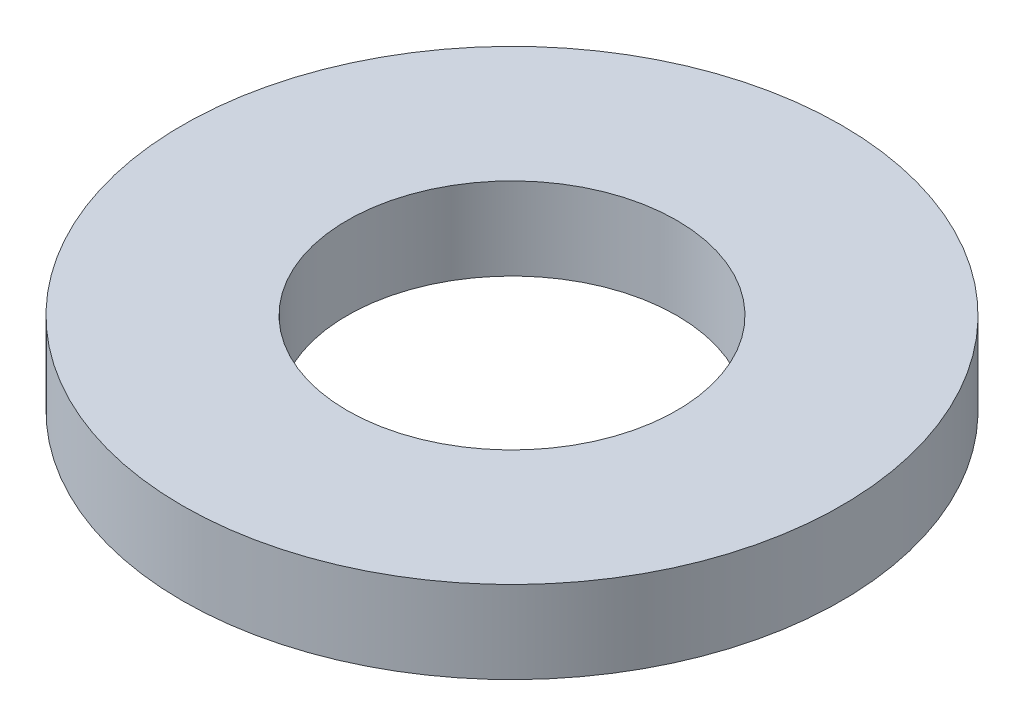
ISO-10303-21;
HEADER;
FILE_DESCRIPTION(('STEP AP214'),'2;1');
FILE_NAME('part.step','',(''),(''),'','','');
FILE_SCHEMA(('AUTOMOTIVE_DESIGN { 1 0 10303 214 1 1 1 1 }'));
ENDSEC;
DATA;
#1=APPLICATION_CONTEXT('core data for automotive mechanical design processes');
#2=APPLICATION_PROTOCOL_DEFINITION('international standard','automotive_design',2000,#1);
#3=PRODUCT_CONTEXT('',#1,'mechanical');
#4=PRODUCT('Part','Part','',(#3));
#5=PRODUCT_RELATED_PRODUCT_CATEGORY('part','',(#4));
#6=PRODUCT_DEFINITION_FORMATION('','',#4);
#7=PRODUCT_DEFINITION_CONTEXT('part definition',#1,'design');
#8=PRODUCT_DEFINITION('design','',#6,#7);
#9=PRODUCT_DEFINITION_SHAPE('','',#8);
#10=(LENGTH_UNIT() NAMED_UNIT(*) SI_UNIT(.MILLI.,.METRE.));
#11=(NAMED_UNIT(*) PLANE_ANGLE_UNIT() SI_UNIT($,.RADIAN.));
#12=(NAMED_UNIT(*) SI_UNIT($,.STERADIAN.) SOLID_ANGLE_UNIT());
#13=UNCERTAINTY_MEASURE_WITH_UNIT(LENGTH_MEASURE(1.E-05),#10,'distance_accuracy_value','');
#14=(GEOMETRIC_REPRESENTATION_CONTEXT(3) GLOBAL_UNCERTAINTY_ASSIGNED_CONTEXT((#13)) GLOBAL_UNIT_ASSIGNED_CONTEXT((#10,
#11,#12)) REPRESENTATION_CONTEXT('',''));
#15=CARTESIAN_POINT('',(0.,0.,0.));
#16=DIRECTION('',(0.,0.,1.));
#17=DIRECTION('',(1.,0.,0.));
#18=AXIS2_PLACEMENT_3D('',#15,#16,#17);
#19=CARTESIAN_POINT('',(0.,6.35,0.));
#20=DIRECTION('',(0.,1.,0.));
#21=DIRECTION('',(0.,0.,1.));
#22=AXIS2_PLACEMENT_3D('',#19,#20,#21);
#23=PLANE('',#22);
#24=CARTESIAN_POINT('',(0.,6.35,0.));
#25=DIRECTION('',(0.,1.,0.));
#26=DIRECTION('',(0.,0.,1.));
#27=AXIS2_PLACEMENT_3D('',#24,#25,#26);
#28=CIRCLE('',#27,25.4);
#29=CARTESIAN_POINT('',(0.,6.35,25.4));
#30=VERTEX_POINT('',#29);
#31=EDGE_CURVE('E10',#30,#30,#28,.T.);
#32=ORIENTED_EDGE('',*,*,#31,.T.);
#33=EDGE_LOOP('',(#32));
#34=FACE_BOUND('',#33,.T.);
#35=CARTESIAN_POINT('',(0.,6.35,0.));
#36=DIRECTION('',(0.,1.,0.));
#37=DIRECTION('',(0.,0.,1.));
#38=AXIS2_PLACEMENT_3D('',#35,#36,#37);
#39=CIRCLE('',#38,12.7);
#40=CARTESIAN_POINT('',(0.,6.35,12.7));
#41=VERTEX_POINT('',#40);
#42=EDGE_CURVE('E50',#41,#41,#39,.T.);
#43=ORIENTED_EDGE('',*,*,#42,.F.);
#44=EDGE_LOOP('',(#43));
#45=FACE_BOUND('',#44,.T.);
#46=ADVANCED_FACE('F37',(#34,#45),#23,.T.);
#47=CARTESIAN_POINT('',(0.,0.,0.));
#48=DIRECTION('',(0.,1.,0.));
#49=DIRECTION('',(0.,0.,1.));
#50=AXIS2_PLACEMENT_3D('',#47,#48,#49);
#51=PLANE('',#50);
#52=CARTESIAN_POINT('',(0.,0.,0.));
#53=DIRECTION('',(0.,1.,0.));
#54=DIRECTION('',(0.,0.,1.));
#55=AXIS2_PLACEMENT_3D('',#52,#53,#54);
#56=CIRCLE('',#55,25.4);
#57=CARTESIAN_POINT('',(0.,0.,25.4));
#58=VERTEX_POINT('',#57);
#59=EDGE_CURVE('E41',#58,#58,#56,.T.);
#60=ORIENTED_EDGE('',*,*,#59,.F.);
#61=EDGE_LOOP('',(#60));
#62=FACE_BOUND('',#61,.T.);
#63=CARTESIAN_POINT('',(0.,0.,0.));
#64=DIRECTION('',(0.,1.,0.));
#65=DIRECTION('',(0.,0.,1.));
#66=AXIS2_PLACEMENT_3D('',#63,#64,#65);
#67=CIRCLE('',#66,12.7);
#68=CARTESIAN_POINT('',(0.,0.,12.7));
#69=VERTEX_POINT('',#68);
#70=EDGE_CURVE('E52',#69,#69,#67,.T.);
#71=ORIENTED_EDGE('',*,*,#70,.T.);
#72=EDGE_LOOP('',(#71));
#73=FACE_BOUND('',#72,.T.);
#74=ADVANCED_FACE('F64',(#62,#73),#51,.F.);
#75=CARTESIAN_POINT('',(0.,6.35,0.));
#76=DIRECTION('',(0.,-1.,0.));
#77=DIRECTION('',(0.,0.,-1.));
#78=AXIS2_PLACEMENT_3D('',#75,#76,#77);
#79=CYLINDRICAL_SURFACE('',#78,25.4);
#80=ORIENTED_EDGE('',*,*,#31,.F.);
#81=EDGE_LOOP('',(#80));
#82=FACE_BOUND('',#81,.T.);
#83=ORIENTED_EDGE('',*,*,#59,.T.);
#84=EDGE_LOOP('',(#83));
#85=FACE_BOUND('',#84,.T.);
#86=ADVANCED_FACE('F39',(#82,#85),#79,.T.);
#87=CARTESIAN_POINT('',(0.,6.35,0.));
#88=DIRECTION('',(0.,-1.,0.));
#89=DIRECTION('',(0.,0.,-1.));
#90=AXIS2_PLACEMENT_3D('',#87,#88,#89);
#91=CYLINDRICAL_SURFACE('',#90,12.7);
#92=ORIENTED_EDGE('',*,*,#42,.T.);
#93=EDGE_LOOP('',(#92));
#94=FACE_BOUND('',#93,.T.);
#95=ORIENTED_EDGE('',*,*,#70,.F.);
#96=EDGE_LOOP('',(#95));
#97=FACE_BOUND('',#96,.T.);
#98=ADVANCED_FACE('F60',(#94,#97),#91,.F.);
#99=CLOSED_SHELL('',(#46,#74,#86,#98));
#100=MANIFOLD_SOLID_BREP('B2',#99);
#101=ADVANCED_BREP_SHAPE_REPRESENTATION('',(#18,#100),#14);
#102=SHAPE_DEFINITION_REPRESENTATION(#9,#101);
ENDSEC;
END-ISO-10303-21;
